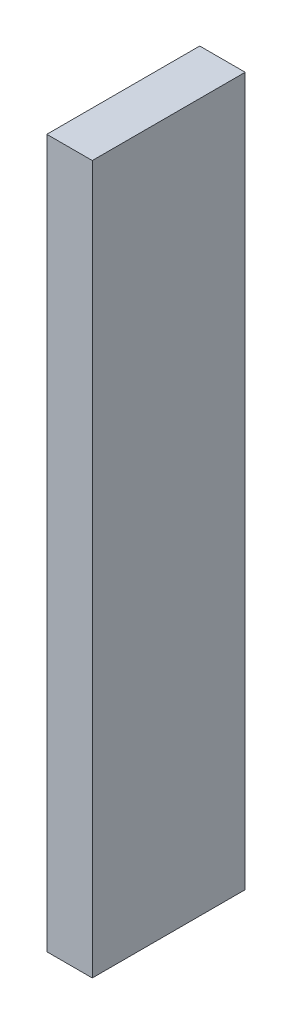
ISO-10303-21;
HEADER;
FILE_DESCRIPTION(('STEP AP214'),'2;1');
FILE_NAME('part.step','',(''),(''),'','','');
FILE_SCHEMA(('AUTOMOTIVE_DESIGN { 1 0 10303 214 1 1 1 1 }'));
ENDSEC;
DATA;
#1=APPLICATION_CONTEXT('core data for automotive mechanical design processes');
#2=APPLICATION_PROTOCOL_DEFINITION('international standard','automotive_design',2000,#1);
#3=PRODUCT_CONTEXT('',#1,'mechanical');
#4=PRODUCT('Part','Part','',(#3));
#5=PRODUCT_RELATED_PRODUCT_CATEGORY('part','',(#4));
#6=PRODUCT_DEFINITION_FORMATION('','',#4);
#7=PRODUCT_DEFINITION_CONTEXT('part definition',#1,'design');
#8=PRODUCT_DEFINITION('design','',#6,#7);
#9=PRODUCT_DEFINITION_SHAPE('','',#8);
#10=(LENGTH_UNIT() NAMED_UNIT(*) SI_UNIT(.MILLI.,.METRE.));
#11=(NAMED_UNIT(*) PLANE_ANGLE_UNIT() SI_UNIT($,.RADIAN.));
#12=(NAMED_UNIT(*) SI_UNIT($,.STERADIAN.) SOLID_ANGLE_UNIT());
#13=UNCERTAINTY_MEASURE_WITH_UNIT(LENGTH_MEASURE(1.E-05),#10,'distance_accuracy_value','');
#14=(GEOMETRIC_REPRESENTATION_CONTEXT(3) GLOBAL_UNCERTAINTY_ASSIGNED_CONTEXT((#13)) GLOBAL_UNIT_ASSIGNED_CONTEXT((#10,
#11,#12)) REPRESENTATION_CONTEXT('',''));
#15=CARTESIAN_POINT('',(0.,0.,0.));
#16=DIRECTION('',(0.,0.,1.));
#17=DIRECTION('',(1.,0.,0.));
#18=AXIS2_PLACEMENT_3D('',#15,#16,#17);
#19=CARTESIAN_POINT('',(130.27554517863,22.4180708263693,106.072028202897));
#20=DIRECTION('',(-1.69244514382854E-09,0.,1.));
#21=DIRECTION('',(1.,0.,1.69244514382854E-09));
#22=AXIS2_PLACEMENT_3D('',#19,#20,#21);
#23=PLANE('',#22);
#24=DIRECTION('',(0.,-1.,0.));
#25=VECTOR('',#24,1.);
#26=CARTESIAN_POINT('',(131.258630275643,22.4180708263693,106.072028204561));
#27=LINE('',#26,#25);
#28=CARTESIAN_POINT('',(131.258630275643,22.4180708263693,106.072028204561));
#29=VERTEX_POINT('',#28);
#30=CARTESIAN_POINT('',(131.258630275643,7.11212965552236,106.072028204561));
#31=VERTEX_POINT('',#30);
#32=EDGE_CURVE('E79',#29,#31,#27,.T.);
#33=ORIENTED_EDGE('',*,*,#32,.F.);
#34=DIRECTION('',(1.,0.,1.69244514382854E-09));
#35=VECTOR('',#34,1.);
#36=CARTESIAN_POINT('',(130.27554517863,22.4180708263693,106.072028202897));
#37=LINE('',#36,#35);
#38=CARTESIAN_POINT('',(130.27554517863,22.4180708263693,106.072028202897));
#39=VERTEX_POINT('',#38);
#40=EDGE_CURVE('E32',#39,#29,#37,.T.);
#41=ORIENTED_EDGE('',*,*,#40,.F.);
#42=DIRECTION('',(0.,-1.,0.));
#43=VECTOR('',#42,1.);
#44=CARTESIAN_POINT('',(130.27554517863,22.4180708263693,106.072028202897));
#45=LINE('',#44,#43);
#46=CARTESIAN_POINT('',(130.27554517863,7.11212965552236,106.072028202897));
#47=VERTEX_POINT('',#46);
#48=EDGE_CURVE('E71',#39,#47,#45,.T.);
#49=ORIENTED_EDGE('',*,*,#48,.T.);
#50=DIRECTION('',(1.,0.,1.69244514382854E-09));
#51=VECTOR('',#50,1.);
#52=CARTESIAN_POINT('',(130.27554517863,7.11212965552236,106.072028202897));
#53=LINE('',#52,#51);
#54=EDGE_CURVE('E10',#47,#31,#53,.T.);
#55=ORIENTED_EDGE('',*,*,#54,.T.);
#56=EDGE_LOOP('',(#33,#41,#49,#55));
#57=FACE_BOUND('',#56,.T.);
#58=ADVANCED_FACE('F16',(#57),#23,.T.);
#59=CARTESIAN_POINT('',(130.27554517863,7.11212965552236,106.072028202897));
#60=DIRECTION('',(0.,-1.,0.));
#61=DIRECTION('',(0.,0.,-1.));
#62=AXIS2_PLACEMENT_3D('',#59,#60,#61);
#63=PLANE('',#62);
#64=DIRECTION('',(1.69244514382854E-09,0.,-1.));
#65=VECTOR('',#64,1.);
#66=CARTESIAN_POINT('',(131.258630275643,7.11212965552236,106.072028204561));
#67=LINE('',#66,#65);
#68=CARTESIAN_POINT('',(131.258630281238,7.11212965552235,102.766087033712));
#69=VERTEX_POINT('',#68);
#70=EDGE_CURVE('E82',#31,#69,#67,.T.);
#71=ORIENTED_EDGE('',*,*,#70,.F.);
#72=ORIENTED_EDGE('',*,*,#54,.F.);
#73=DIRECTION('',(1.69244514382854E-09,0.,-1.));
#74=VECTOR('',#73,1.);
#75=CARTESIAN_POINT('',(130.27554517863,7.11212965552236,106.072028202897));
#76=LINE('',#75,#74);
#77=CARTESIAN_POINT('',(130.275545184225,7.11212965552235,102.766087032048));
#78=VERTEX_POINT('',#77);
#79=EDGE_CURVE('E67',#47,#78,#76,.T.);
#80=ORIENTED_EDGE('',*,*,#79,.T.);
#81=DIRECTION('',(1.,0.,1.69244514382854E-09));
#82=VECTOR('',#81,1.);
#83=CARTESIAN_POINT('',(130.275545184225,7.11212965552235,102.766087032048));
#84=LINE('',#83,#82);
#85=EDGE_CURVE('E24',#78,#69,#84,.T.);
#86=ORIENTED_EDGE('',*,*,#85,.T.);
#87=EDGE_LOOP('',(#71,#72,#80,#86));
#88=FACE_BOUND('',#87,.T.);
#89=ADVANCED_FACE('F68',(#88),#63,.T.);
#90=CARTESIAN_POINT('',(130.275545184225,7.11212965552235,102.766087032048));
#91=DIRECTION('',(1.69244514382854E-09,0.,-1.));
#92=DIRECTION('',(-1.,0.,-1.69244514382854E-09));
#93=AXIS2_PLACEMENT_3D('',#90,#91,#92);
#94=PLANE('',#93);
#95=DIRECTION('',(0.,1.,0.));
#96=VECTOR('',#95,1.);
#97=CARTESIAN_POINT('',(131.258630281238,7.11212965552235,102.766087033712));
#98=LINE('',#97,#96);
#99=CARTESIAN_POINT('',(131.258630281238,22.418070826371,102.766087025251));
#100=VERTEX_POINT('',#99);
#101=EDGE_CURVE('E65',#69,#100,#98,.T.);
#102=ORIENTED_EDGE('',*,*,#101,.F.);
#103=ORIENTED_EDGE('',*,*,#85,.F.);
#104=DIRECTION('',(0.,1.,0.));
#105=VECTOR('',#104,1.);
#106=CARTESIAN_POINT('',(130.275545184225,7.11212965552235,102.766087032048));
#107=LINE('',#106,#105);
#108=CARTESIAN_POINT('',(130.275545184225,22.418070826371,102.766087023588));
#109=VERTEX_POINT('',#108);
#110=EDGE_CURVE('E62',#78,#109,#107,.T.);
#111=ORIENTED_EDGE('',*,*,#110,.T.);
#112=DIRECTION('',(1.,0.,1.69244514382854E-09));
#113=VECTOR('',#112,1.);
#114=CARTESIAN_POINT('',(130.275545184225,22.418070826371,102.766087023588));
#115=LINE('',#114,#113);
#116=EDGE_CURVE('E48',#109,#100,#115,.T.);
#117=ORIENTED_EDGE('',*,*,#116,.T.);
#118=EDGE_LOOP('',(#102,#103,#111,#117));
#119=FACE_BOUND('',#118,.T.);
#120=ADVANCED_FACE('F60',(#119),#94,.T.);
#121=CARTESIAN_POINT('',(130.275545184225,22.418070826371,102.766087023588));
#122=DIRECTION('',(0.,1.,0.));
#123=DIRECTION('',(-1.,0.,0.));
#124=AXIS2_PLACEMENT_3D('',#121,#122,#123);
#125=PLANE('',#124);
#126=DIRECTION('',(-1.69244514382854E-09,0.,1.));
#127=VECTOR('',#126,1.);
#128=CARTESIAN_POINT('',(131.258630281238,22.418070826371,102.766087025251));
#129=LINE('',#128,#127);
#130=EDGE_CURVE('E85',#100,#29,#129,.T.);
#131=ORIENTED_EDGE('',*,*,#130,.F.);
#132=ORIENTED_EDGE('',*,*,#116,.F.);
#133=DIRECTION('',(-1.69244514382854E-09,0.,1.));
#134=VECTOR('',#133,1.);
#135=CARTESIAN_POINT('',(130.275545184225,22.418070826371,102.766087023588));
#136=LINE('',#135,#134);
#137=EDGE_CURVE('E74',#109,#39,#136,.T.);
#138=ORIENTED_EDGE('',*,*,#137,.T.);
#139=ORIENTED_EDGE('',*,*,#40,.T.);
#140=EDGE_LOOP('',(#131,#132,#138,#139));
#141=FACE_BOUND('',#140,.T.);
#142=ADVANCED_FACE('F96',(#141),#125,.T.);
#143=CARTESIAN_POINT('',(130.275545201028,17.2651002409467,92.8378644340291));
#144=DIRECTION('',(1.,0.,1.69244514382854E-09));
#145=DIRECTION('',(0.,1.,0.));
#146=AXIS2_PLACEMENT_3D('',#143,#144,#145);
#147=PLANE('',#146);
#148=ORIENTED_EDGE('',*,*,#48,.F.);
#149=ORIENTED_EDGE('',*,*,#137,.F.);
#150=ORIENTED_EDGE('',*,*,#110,.F.);
#151=ORIENTED_EDGE('',*,*,#79,.F.);
#152=EDGE_LOOP('',(#148,#149,#150,#151));
#153=FACE_BOUND('',#152,.T.);
#154=ADVANCED_FACE('F73',(#153),#147,.F.);
#155=CARTESIAN_POINT('',(131.258630298041,17.2651002409467,92.8378644356929));
#156=DIRECTION('',(1.,0.,1.69244514382854E-09));
#157=DIRECTION('',(0.,1.,0.));
#158=AXIS2_PLACEMENT_3D('',#155,#156,#157);
#159=PLANE('',#158);
#160=ORIENTED_EDGE('',*,*,#32,.T.);
#161=ORIENTED_EDGE('',*,*,#70,.T.);
#162=ORIENTED_EDGE('',*,*,#101,.T.);
#163=ORIENTED_EDGE('',*,*,#130,.T.);
#164=EDGE_LOOP('',(#160,#161,#162,#163));
#165=FACE_BOUND('',#164,.T.);
#166=ADVANCED_FACE('F89',(#165),#159,.T.);
#167=CLOSED_SHELL('',(#58,#89,#120,#142,#154,#166));
#168=MANIFOLD_SOLID_BREP('B1',#167);
#169=ADVANCED_BREP_SHAPE_REPRESENTATION('',(#18,#168),#14);
#170=SHAPE_DEFINITION_REPRESENTATION(#9,#169);
ENDSEC;
END-ISO-10303-21;
